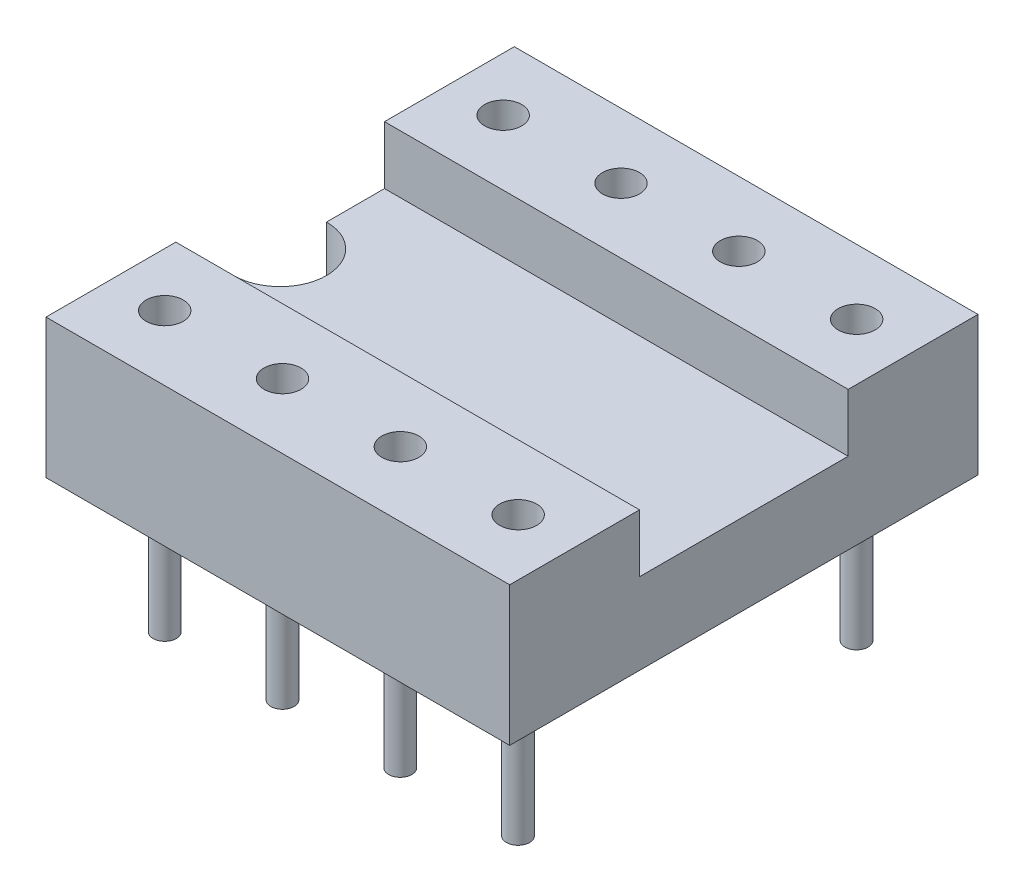
ISO-10303-21;
HEADER;
FILE_DESCRIPTION(('STEP AP214'),'2;1');
FILE_NAME('part.step','',(''),(''),'','','');
FILE_SCHEMA(('AUTOMOTIVE_DESIGN { 1 0 10303 214 1 1 1 1 }'));
ENDSEC;
DATA;
#1=APPLICATION_CONTEXT('core data for automotive mechanical design processes');
#2=APPLICATION_PROTOCOL_DEFINITION('international standard','automotive_design',2000,#1);
#3=PRODUCT_CONTEXT('',#1,'mechanical');
#4=PRODUCT('Part','Part','',(#3));
#5=PRODUCT_RELATED_PRODUCT_CATEGORY('part','',(#4));
#6=PRODUCT_DEFINITION_FORMATION('','',#4);
#7=PRODUCT_DEFINITION_CONTEXT('part definition',#1,'design');
#8=PRODUCT_DEFINITION('design','',#6,#7);
#9=PRODUCT_DEFINITION_SHAPE('','',#8);
#10=(LENGTH_UNIT() NAMED_UNIT(*) SI_UNIT(.MILLI.,.METRE.));
#11=(NAMED_UNIT(*) PLANE_ANGLE_UNIT() SI_UNIT($,.RADIAN.));
#12=(NAMED_UNIT(*) SI_UNIT($,.STERADIAN.) SOLID_ANGLE_UNIT());
#13=UNCERTAINTY_MEASURE_WITH_UNIT(LENGTH_MEASURE(1.E-05),#10,'distance_accuracy_value','');
#14=(GEOMETRIC_REPRESENTATION_CONTEXT(3) GLOBAL_UNCERTAINTY_ASSIGNED_CONTEXT((#13)) GLOBAL_UNIT_ASSIGNED_CONTEXT((#10,
#11,#12)) REPRESENTATION_CONTEXT('',''));
#15=CARTESIAN_POINT('',(0.,0.,0.));
#16=DIRECTION('',(0.,0.,1.));
#17=DIRECTION('',(1.,0.,0.));
#18=AXIS2_PLACEMENT_3D('',#15,#16,#17);
#19=CARTESIAN_POINT('',(10.,0.,5.05));
#20=DIRECTION('',(0.,1.,0.));
#21=DIRECTION('',(0.,0.,1.));
#22=AXIS2_PLACEMENT_3D('',#19,#20,#21);
#23=PLANE('',#22);
#24=CARTESIAN_POINT('',(8.78,0.,3.65));
#25=DIRECTION('',(0.,1.,0.));
#26=DIRECTION('',(0.,0.,1.));
#27=AXIS2_PLACEMENT_3D('',#24,#25,#26);
#28=CIRCLE('',#27,0.25);
#29=CARTESIAN_POINT('',(8.78,0.,3.9));
#30=VERTEX_POINT('',#29);
#31=EDGE_CURVE('E42',#30,#30,#28,.F.);
#32=ORIENTED_EDGE('',*,*,#31,.F.);
#33=EDGE_LOOP('',(#32));
#34=FACE_BOUND('',#33,.T.);
#35=CARTESIAN_POINT('',(6.24,0.,3.65));
#36=DIRECTION('',(0.,1.,0.));
#37=DIRECTION('',(0.,0.,1.));
#38=AXIS2_PLACEMENT_3D('',#35,#36,#37);
#39=CIRCLE('',#38,0.25);
#40=CARTESIAN_POINT('',(6.24,0.,3.9));
#41=VERTEX_POINT('',#40);
#42=EDGE_CURVE('E200',#41,#41,#39,.F.);
#43=ORIENTED_EDGE('',*,*,#42,.F.);
#44=EDGE_LOOP('',(#43));
#45=FACE_BOUND('',#44,.T.);
#46=CARTESIAN_POINT('',(3.7,0.,3.65));
#47=DIRECTION('',(0.,1.,0.));
#48=DIRECTION('',(0.,0.,1.));
#49=AXIS2_PLACEMENT_3D('',#46,#47,#48);
#50=CIRCLE('',#49,0.25);
#51=CARTESIAN_POINT('',(3.7,0.,3.9));
#52=VERTEX_POINT('',#51);
#53=EDGE_CURVE('E194',#52,#52,#50,.F.);
#54=ORIENTED_EDGE('',*,*,#53,.F.);
#55=EDGE_LOOP('',(#54));
#56=FACE_BOUND('',#55,.T.);
#57=CARTESIAN_POINT('',(1.16,0.,3.65));
#58=DIRECTION('',(0.,1.,0.));
#59=DIRECTION('',(0.,0.,1.));
#60=AXIS2_PLACEMENT_3D('',#57,#58,#59);
#61=CIRCLE('',#60,0.25);
#62=CARTESIAN_POINT('',(1.16,0.,3.9));
#63=VERTEX_POINT('',#62);
#64=EDGE_CURVE('E188',#63,#63,#61,.F.);
#65=ORIENTED_EDGE('',*,*,#64,.F.);
#66=EDGE_LOOP('',(#65));
#67=FACE_BOUND('',#66,.T.);
#68=DIRECTION('',(0.,0.,-1.));
#69=VECTOR('',#68,1.);
#70=CARTESIAN_POINT('',(0.,0.,5.05));
#71=LINE('',#70,#69);
#72=CARTESIAN_POINT('',(0.,0.,5.05));
#73=VERTEX_POINT('',#72);
#74=CARTESIAN_POINT('',(0.,0.,1.));
#75=VERTEX_POINT('',#74);
#76=EDGE_CURVE('E142',#73,#75,#71,.T.);
#77=ORIENTED_EDGE('',*,*,#76,.T.);
#78=CARTESIAN_POINT('',(0.,0.,0.));
#79=DIRECTION('',(0.,1.,0.));
#80=DIRECTION('',(0.,0.,1.));
#81=AXIS2_PLACEMENT_3D('',#78,#79,#80);
#82=CIRCLE('',#81,1.);
#83=CARTESIAN_POINT('',(0.,0.,-1.));
#84=VERTEX_POINT('',#83);
#85=EDGE_CURVE('E49',#75,#84,#82,.T.);
#86=ORIENTED_EDGE('',*,*,#85,.T.);
#87=CARTESIAN_POINT('',(0.,0.,-5.05));
#88=VERTEX_POINT('',#87);
#89=EDGE_CURVE('E127',#84,#88,#71,.T.);
#90=ORIENTED_EDGE('',*,*,#89,.T.);
#91=DIRECTION('',(-1.,0.,0.));
#92=VECTOR('',#91,1.);
#93=CARTESIAN_POINT('',(10.,0.,-5.05));
#94=LINE('',#93,#92);
#95=CARTESIAN_POINT('',(10.,0.,-5.05));
#96=VERTEX_POINT('',#95);
#97=EDGE_CURVE('E173',#96,#88,#94,.T.);
#98=ORIENTED_EDGE('',*,*,#97,.F.);
#99=DIRECTION('',(0.,0.,-1.));
#100=VECTOR('',#99,1.);
#101=CARTESIAN_POINT('',(10.,0.,5.05));
#102=LINE('',#101,#100);
#103=CARTESIAN_POINT('',(10.,0.,5.05));
#104=VERTEX_POINT('',#103);
#105=EDGE_CURVE('E159',#104,#96,#102,.T.);
#106=ORIENTED_EDGE('',*,*,#105,.F.);
#107=DIRECTION('',(-1.,0.,0.));
#108=VECTOR('',#107,1.);
#109=CARTESIAN_POINT('',(10.,0.,5.05));
#110=LINE('',#109,#108);
#111=EDGE_CURVE('E176',#104,#73,#110,.T.);
#112=ORIENTED_EDGE('',*,*,#111,.T.);
#113=EDGE_LOOP('',(#77,#86,#90,#98,#106,#112));
#114=FACE_BOUND('',#113,.T.);
#115=CARTESIAN_POINT('',(1.16,0.,-3.65));
#116=DIRECTION('',(0.,1.,0.));
#117=DIRECTION('',(0.,0.,1.));
#118=AXIS2_PLACEMENT_3D('',#115,#116,#117);
#119=CIRCLE('',#118,0.25);
#120=CARTESIAN_POINT('',(1.16,0.,-3.4));
#121=VERTEX_POINT('',#120);
#122=EDGE_CURVE('E191',#121,#121,#119,.F.);
#123=ORIENTED_EDGE('',*,*,#122,.F.);
#124=EDGE_LOOP('',(#123));
#125=FACE_BOUND('',#124,.T.);
#126=CARTESIAN_POINT('',(3.7,0.,-3.65));
#127=DIRECTION('',(0.,1.,0.));
#128=DIRECTION('',(0.,0.,1.));
#129=AXIS2_PLACEMENT_3D('',#126,#127,#128);
#130=CIRCLE('',#129,0.25);
#131=CARTESIAN_POINT('',(3.7,0.,-3.4));
#132=VERTEX_POINT('',#131);
#133=EDGE_CURVE('E197',#132,#132,#130,.F.);
#134=ORIENTED_EDGE('',*,*,#133,.F.);
#135=EDGE_LOOP('',(#134));
#136=FACE_BOUND('',#135,.T.);
#137=CARTESIAN_POINT('',(6.24,0.,-3.65));
#138=DIRECTION('',(0.,1.,0.));
#139=DIRECTION('',(0.,0.,1.));
#140=AXIS2_PLACEMENT_3D('',#137,#138,#139);
#141=CIRCLE('',#140,0.25);
#142=CARTESIAN_POINT('',(6.24,0.,-3.4));
#143=VERTEX_POINT('',#142);
#144=EDGE_CURVE('E203',#143,#143,#141,.F.);
#145=ORIENTED_EDGE('',*,*,#144,.F.);
#146=EDGE_LOOP('',(#145));
#147=FACE_BOUND('',#146,.T.);
#148=CARTESIAN_POINT('',(8.78,0.,-3.65));
#149=DIRECTION('',(0.,1.,0.));
#150=DIRECTION('',(0.,0.,1.));
#151=AXIS2_PLACEMENT_3D('',#148,#149,#150);
#152=CIRCLE('',#151,0.25);
#153=CARTESIAN_POINT('',(8.78,0.,-3.4));
#154=VERTEX_POINT('',#153);
#155=EDGE_CURVE('E11',#154,#154,#152,.F.);
#156=ORIENTED_EDGE('',*,*,#155,.F.);
#157=EDGE_LOOP('',(#156));
#158=FACE_BOUND('',#157,.T.);
#159=ADVANCED_FACE('F34',(#34,#45,#56,#67,#114,#125,#136,#147,#158),#23,.F.);
#160=CARTESIAN_POINT('',(0.,1.75,5.05));
#161=DIRECTION('',(1.,0.,0.));
#162=DIRECTION('',(0.,0.,-1.));
#163=AXIS2_PLACEMENT_3D('',#160,#161,#162);
#164=PLANE('',#163);
#165=ORIENTED_EDGE('',*,*,#89,.F.);
#166=DIRECTION('',(0.,1.,0.));
#167=VECTOR('',#166,1.);
#168=CARTESIAN_POINT('',(0.,0.,-1.));
#169=LINE('',#168,#167);
#170=CARTESIAN_POINT('',(0.,1.75,-1.));
#171=VERTEX_POINT('',#170);
#172=EDGE_CURVE('E113',#84,#171,#169,.T.);
#173=ORIENTED_EDGE('',*,*,#172,.T.);
#174=DIRECTION('',(0.,0.,1.));
#175=VECTOR('',#174,1.);
#176=CARTESIAN_POINT('',(0.,1.75,-2.25));
#177=LINE('',#176,#175);
#178=CARTESIAN_POINT('',(0.,1.75,-2.25));
#179=VERTEX_POINT('',#178);
#180=EDGE_CURVE('E125',#179,#171,#177,.T.);
#181=ORIENTED_EDGE('',*,*,#180,.F.);
#182=DIRECTION('',(0.,-1.,0.));
#183=VECTOR('',#182,1.);
#184=CARTESIAN_POINT('',(0.,3.,-2.25));
#185=LINE('',#184,#183);
#186=CARTESIAN_POINT('',(0.,3.,-2.25));
#187=VERTEX_POINT('',#186);
#188=EDGE_CURVE('E149',#187,#179,#185,.T.);
#189=ORIENTED_EDGE('',*,*,#188,.F.);
#190=DIRECTION('',(0.,0.,1.));
#191=VECTOR('',#190,1.);
#192=CARTESIAN_POINT('',(0.,3.,-5.05));
#193=LINE('',#192,#191);
#194=CARTESIAN_POINT('',(0.,3.,-5.05));
#195=VERTEX_POINT('',#194);
#196=EDGE_CURVE('E147',#195,#187,#193,.T.);
#197=ORIENTED_EDGE('',*,*,#196,.F.);
#198=DIRECTION('',(0.,1.,0.));
#199=VECTOR('',#198,1.);
#200=CARTESIAN_POINT('',(0.,0.,-5.05));
#201=LINE('',#200,#199);
#202=EDGE_CURVE('E145',#88,#195,#201,.T.);
#203=ORIENTED_EDGE('',*,*,#202,.F.);
#204=EDGE_LOOP('',(#165,#173,#181,#189,#197,#203));
#205=FACE_BOUND('',#204,.T.);
#206=ADVANCED_FACE('F123',(#205),#164,.F.);
#207=CARTESIAN_POINT('',(10.,1.75,-2.25));
#208=DIRECTION('',(0.,-1.,0.));
#209=DIRECTION('',(0.,0.,-1.));
#210=AXIS2_PLACEMENT_3D('',#207,#208,#209);
#211=PLANE('',#210);
#212=ORIENTED_EDGE('',*,*,#180,.T.);
#213=CARTESIAN_POINT('',(0.,1.75,0.));
#214=DIRECTION('',(0.,1.,0.));
#215=DIRECTION('',(0.,0.,1.));
#216=AXIS2_PLACEMENT_3D('',#213,#214,#215);
#217=CIRCLE('',#216,1.);
#218=CARTESIAN_POINT('',(0.,1.75,1.));
#219=VERTEX_POINT('',#218);
#220=EDGE_CURVE('E110',#219,#171,#217,.T.);
#221=ORIENTED_EDGE('',*,*,#220,.F.);
#222=CARTESIAN_POINT('',(0.,1.75,2.25));
#223=VERTEX_POINT('',#222);
#224=EDGE_CURVE('E133',#219,#223,#177,.T.);
#225=ORIENTED_EDGE('',*,*,#224,.T.);
#226=DIRECTION('',(-1.,0.,0.));
#227=VECTOR('',#226,1.);
#228=CARTESIAN_POINT('',(10.,1.75,2.25));
#229=LINE('',#228,#227);
#230=CARTESIAN_POINT('',(10.,1.75,2.25));
#231=VERTEX_POINT('',#230);
#232=EDGE_CURVE('E185',#231,#223,#229,.T.);
#233=ORIENTED_EDGE('',*,*,#232,.F.);
#234=DIRECTION('',(0.,0.,1.));
#235=VECTOR('',#234,1.);
#236=CARTESIAN_POINT('',(10.,1.75,-2.25));
#237=LINE('',#236,#235);
#238=CARTESIAN_POINT('',(10.,1.75,-2.25));
#239=VERTEX_POINT('',#238);
#240=EDGE_CURVE('E151',#239,#231,#237,.T.);
#241=ORIENTED_EDGE('',*,*,#240,.F.);
#242=DIRECTION('',(-1.,0.,0.));
#243=VECTOR('',#242,1.);
#244=CARTESIAN_POINT('',(10.,1.75,-2.25));
#245=LINE('',#244,#243);
#246=EDGE_CURVE('E131',#239,#179,#245,.T.);
#247=ORIENTED_EDGE('',*,*,#246,.T.);
#248=EDGE_LOOP('',(#212,#221,#225,#233,#241,#247));
#249=FACE_BOUND('',#248,.T.);
#250=ADVANCED_FACE('F36',(#249),#211,.F.);
#251=CARTESIAN_POINT('',(10.,1.75,2.25));
#252=DIRECTION('',(0.,0.,1.));
#253=DIRECTION('',(0.,-1.,0.));
#254=AXIS2_PLACEMENT_3D('',#251,#252,#253);
#255=PLANE('',#254);
#256=DIRECTION('',(0.,1.,0.));
#257=VECTOR('',#256,1.);
#258=CARTESIAN_POINT('',(0.,1.75,2.25));
#259=LINE('',#258,#257);
#260=CARTESIAN_POINT('',(0.,3.,2.25));
#261=VERTEX_POINT('',#260);
#262=EDGE_CURVE('E132',#223,#261,#259,.T.);
#263=ORIENTED_EDGE('',*,*,#262,.T.);
#264=DIRECTION('',(-1.,0.,0.));
#265=VECTOR('',#264,1.);
#266=CARTESIAN_POINT('',(10.,3.,2.25));
#267=LINE('',#266,#265);
#268=CARTESIAN_POINT('',(10.,3.,2.25));
#269=VERTEX_POINT('',#268);
#270=EDGE_CURVE('E182',#269,#261,#267,.T.);
#271=ORIENTED_EDGE('',*,*,#270,.F.);
#272=DIRECTION('',(0.,1.,0.));
#273=VECTOR('',#272,1.);
#274=CARTESIAN_POINT('',(10.,1.75,2.25));
#275=LINE('',#274,#273);
#276=EDGE_CURVE('E153',#231,#269,#275,.T.);
#277=ORIENTED_EDGE('',*,*,#276,.F.);
#278=ORIENTED_EDGE('',*,*,#232,.T.);
#279=EDGE_LOOP('',(#263,#271,#277,#278));
#280=FACE_BOUND('',#279,.T.);
#281=ADVANCED_FACE('F387',(#280),#255,.F.);
#282=CARTESIAN_POINT('',(10.,3.,2.25));
#283=DIRECTION('',(0.,-1.,0.));
#284=DIRECTION('',(0.,0.,-1.));
#285=AXIS2_PLACEMENT_3D('',#282,#283,#284);
#286=PLANE('',#285);
#287=CARTESIAN_POINT('',(8.783,3.,3.64999999999995));
#288=DIRECTION('',(0.,1.,0.));
#289=DIRECTION('',(0.,0.,1.));
#290=AXIS2_PLACEMENT_3D('',#287,#288,#289);
#291=CIRCLE('',#290,0.399999999999999);
#292=CARTESIAN_POINT('',(8.783,3.,4.04999999999995));
#293=VERTEX_POINT('',#292);
#294=EDGE_CURVE('E448',#293,#293,#291,.T.);
#295=ORIENTED_EDGE('',*,*,#294,.F.);
#296=EDGE_LOOP('',(#295));
#297=FACE_BOUND('',#296,.T.);
#298=CARTESIAN_POINT('',(6.242,3.,3.64999999999996));
#299=DIRECTION('',(0.,1.,0.));
#300=DIRECTION('',(0.,0.,1.));
#301=AXIS2_PLACEMENT_3D('',#298,#299,#300);
#302=CIRCLE('',#301,0.4);
#303=CARTESIAN_POINT('',(6.242,3.,4.04999999999996));
#304=VERTEX_POINT('',#303);
#305=EDGE_CURVE('E436',#304,#304,#302,.T.);
#306=ORIENTED_EDGE('',*,*,#305,.F.);
#307=EDGE_LOOP('',(#306));
#308=FACE_BOUND('',#307,.T.);
#309=CARTESIAN_POINT('',(3.701,3.,3.64999999999998));
#310=DIRECTION('',(0.,1.,0.));
#311=DIRECTION('',(0.,0.,1.));
#312=AXIS2_PLACEMENT_3D('',#309,#310,#311);
#313=CIRCLE('',#312,0.4);
#314=CARTESIAN_POINT('',(3.701,3.,4.04999999999998));
#315=VERTEX_POINT('',#314);
#316=EDGE_CURVE('E424',#315,#315,#313,.T.);
#317=ORIENTED_EDGE('',*,*,#316,.F.);
#318=EDGE_LOOP('',(#317));
#319=FACE_BOUND('',#318,.T.);
#320=CARTESIAN_POINT('',(1.16,3.,3.65));
#321=DIRECTION('',(0.,1.,0.));
#322=DIRECTION('',(0.,0.,1.));
#323=AXIS2_PLACEMENT_3D('',#320,#321,#322);
#324=CIRCLE('',#323,0.4);
#325=CARTESIAN_POINT('',(1.16,3.,4.05));
#326=VERTEX_POINT('',#325);
#327=EDGE_CURVE('E412',#326,#326,#324,.T.);
#328=ORIENTED_EDGE('',*,*,#327,.F.);
#329=EDGE_LOOP('',(#328));
#330=FACE_BOUND('',#329,.T.);
#331=DIRECTION('',(0.,0.,1.));
#332=VECTOR('',#331,1.);
#333=CARTESIAN_POINT('',(0.,3.,2.25));
#334=LINE('',#333,#332);
#335=CARTESIAN_POINT('',(0.,3.,5.05));
#336=VERTEX_POINT('',#335);
#337=EDGE_CURVE('E135',#261,#336,#334,.T.);
#338=ORIENTED_EDGE('',*,*,#337,.T.);
#339=DIRECTION('',(-1.,0.,0.));
#340=VECTOR('',#339,1.);
#341=CARTESIAN_POINT('',(10.,3.,5.05));
#342=LINE('',#341,#340);
#343=CARTESIAN_POINT('',(10.,3.,5.05));
#344=VERTEX_POINT('',#343);
#345=EDGE_CURVE('E179',#344,#336,#342,.T.);
#346=ORIENTED_EDGE('',*,*,#345,.F.);
#347=DIRECTION('',(0.,0.,1.));
#348=VECTOR('',#347,1.);
#349=CARTESIAN_POINT('',(10.,3.,2.25));
#350=LINE('',#349,#348);
#351=EDGE_CURVE('E155',#269,#344,#350,.T.);
#352=ORIENTED_EDGE('',*,*,#351,.F.);
#353=ORIENTED_EDGE('',*,*,#270,.T.);
#354=EDGE_LOOP('',(#338,#346,#352,#353));
#355=FACE_BOUND('',#354,.T.);
#356=ADVANCED_FACE('F384',(#297,#308,#319,#330,#355),#286,.F.);
#357=CARTESIAN_POINT('',(10.,3.,5.05));
#358=DIRECTION('',(0.,0.,-1.));
#359=DIRECTION('',(-1.,0.,0.));
#360=AXIS2_PLACEMENT_3D('',#357,#358,#359);
#361=PLANE('',#360);
#362=DIRECTION('',(0.,-1.,0.));
#363=VECTOR('',#362,1.);
#364=CARTESIAN_POINT('',(0.,3.,5.05));
#365=LINE('',#364,#363);
#366=EDGE_CURVE('E140',#336,#73,#365,.T.);
#367=ORIENTED_EDGE('',*,*,#366,.T.);
#368=ORIENTED_EDGE('',*,*,#111,.F.);
#369=DIRECTION('',(0.,-1.,0.));
#370=VECTOR('',#369,1.);
#371=CARTESIAN_POINT('',(10.,3.,5.05));
#372=LINE('',#371,#370);
#373=EDGE_CURVE('E157',#344,#104,#372,.T.);
#374=ORIENTED_EDGE('',*,*,#373,.F.);
#375=ORIENTED_EDGE('',*,*,#345,.T.);
#376=EDGE_LOOP('',(#367,#368,#374,#375));
#377=FACE_BOUND('',#376,.T.);
#378=ADVANCED_FACE('F379',(#377),#361,.F.);
#379=CARTESIAN_POINT('',(10.,0.,-5.05));
#380=DIRECTION('',(0.,0.,1.));
#381=DIRECTION('',(0.,-1.,0.));
#382=AXIS2_PLACEMENT_3D('',#379,#380,#381);
#383=PLANE('',#382);
#384=ORIENTED_EDGE('',*,*,#202,.T.);
#385=DIRECTION('',(-1.,0.,0.));
#386=VECTOR('',#385,1.);
#387=CARTESIAN_POINT('',(10.,3.,-5.05));
#388=LINE('',#387,#386);
#389=CARTESIAN_POINT('',(10.,3.,-5.05));
#390=VERTEX_POINT('',#389);
#391=EDGE_CURVE('E170',#390,#195,#388,.T.);
#392=ORIENTED_EDGE('',*,*,#391,.F.);
#393=DIRECTION('',(0.,1.,0.));
#394=VECTOR('',#393,1.);
#395=CARTESIAN_POINT('',(10.,0.,-5.05));
#396=LINE('',#395,#394);
#397=EDGE_CURVE('E161',#96,#390,#396,.T.);
#398=ORIENTED_EDGE('',*,*,#397,.F.);
#399=ORIENTED_EDGE('',*,*,#97,.T.);
#400=EDGE_LOOP('',(#384,#392,#398,#399));
#401=FACE_BOUND('',#400,.T.);
#402=ADVANCED_FACE('F376',(#401),#383,.F.);
#403=CARTESIAN_POINT('',(10.,3.,-5.05));
#404=DIRECTION('',(0.,-1.,0.));
#405=DIRECTION('',(0.,0.,-1.));
#406=AXIS2_PLACEMENT_3D('',#403,#404,#405);
#407=PLANE('',#406);
#408=CARTESIAN_POINT('',(8.783,3.,-3.65000000000005));
#409=DIRECTION('',(0.,1.,0.));
#410=DIRECTION('',(0.,0.,-1.));
#411=AXIS2_PLACEMENT_3D('',#408,#409,#410);
#412=CIRCLE('',#411,0.399999999999999);
#413=CARTESIAN_POINT('',(8.783,3.,-4.05000000000005));
#414=VERTEX_POINT('',#413);
#415=EDGE_CURVE('E454',#414,#414,#412,.T.);
#416=ORIENTED_EDGE('',*,*,#415,.F.);
#417=EDGE_LOOP('',(#416));
#418=FACE_BOUND('',#417,.T.);
#419=CARTESIAN_POINT('',(6.242,3.,-3.65000000000003));
#420=DIRECTION('',(0.,1.,0.));
#421=DIRECTION('',(0.,0.,-1.));
#422=AXIS2_PLACEMENT_3D('',#419,#420,#421);
#423=CIRCLE('',#422,0.4);
#424=CARTESIAN_POINT('',(6.242,3.,-4.05000000000004));
#425=VERTEX_POINT('',#424);
#426=EDGE_CURVE('E442',#425,#425,#423,.T.);
#427=ORIENTED_EDGE('',*,*,#426,.F.);
#428=EDGE_LOOP('',(#427));
#429=FACE_BOUND('',#428,.T.);
#430=CARTESIAN_POINT('',(3.701,3.,-3.65000000000002));
#431=DIRECTION('',(0.,1.,0.));
#432=DIRECTION('',(0.,0.,-1.));
#433=AXIS2_PLACEMENT_3D('',#430,#431,#432);
#434=CIRCLE('',#433,0.4);
#435=CARTESIAN_POINT('',(3.701,3.,-4.05000000000002));
#436=VERTEX_POINT('',#435);
#437=EDGE_CURVE('E430',#436,#436,#434,.T.);
#438=ORIENTED_EDGE('',*,*,#437,.F.);
#439=EDGE_LOOP('',(#438));
#440=FACE_BOUND('',#439,.T.);
#441=CARTESIAN_POINT('',(1.16,3.,-3.65));
#442=DIRECTION('',(0.,1.,0.));
#443=DIRECTION('',(0.,0.,-1.));
#444=AXIS2_PLACEMENT_3D('',#441,#442,#443);
#445=CIRCLE('',#444,0.4);
#446=CARTESIAN_POINT('',(1.16,3.,-4.05));
#447=VERTEX_POINT('',#446);
#448=EDGE_CURVE('E418',#447,#447,#445,.T.);
#449=ORIENTED_EDGE('',*,*,#448,.F.);
#450=EDGE_LOOP('',(#449));
#451=FACE_BOUND('',#450,.T.);
#452=ORIENTED_EDGE('',*,*,#196,.T.);
#453=DIRECTION('',(-1.,0.,0.));
#454=VECTOR('',#453,1.);
#455=CARTESIAN_POINT('',(10.,3.,-2.25));
#456=LINE('',#455,#454);
#457=CARTESIAN_POINT('',(10.,3.,-2.25));
#458=VERTEX_POINT('',#457);
#459=EDGE_CURVE('E167',#458,#187,#456,.T.);
#460=ORIENTED_EDGE('',*,*,#459,.F.);
#461=DIRECTION('',(0.,0.,1.));
#462=VECTOR('',#461,1.);
#463=CARTESIAN_POINT('',(10.,3.,-5.05));
#464=LINE('',#463,#462);
#465=EDGE_CURVE('E163',#390,#458,#464,.T.);
#466=ORIENTED_EDGE('',*,*,#465,.F.);
#467=ORIENTED_EDGE('',*,*,#391,.T.);
#468=EDGE_LOOP('',(#452,#460,#466,#467));
#469=FACE_BOUND('',#468,.T.);
#470=ADVANCED_FACE('F372',(#418,#429,#440,#451,#469),#407,.F.);
#471=CARTESIAN_POINT('',(10.,3.,-2.25));
#472=DIRECTION('',(0.,0.,-1.));
#473=DIRECTION('',(0.,1.,0.));
#474=AXIS2_PLACEMENT_3D('',#471,#472,#473);
#475=PLANE('',#474);
#476=ORIENTED_EDGE('',*,*,#188,.T.);
#477=ORIENTED_EDGE('',*,*,#246,.F.);
#478=DIRECTION('',(0.,-1.,0.));
#479=VECTOR('',#478,1.);
#480=CARTESIAN_POINT('',(10.,3.,-2.25));
#481=LINE('',#480,#479);
#482=EDGE_CURVE('E57',#458,#239,#481,.T.);
#483=ORIENTED_EDGE('',*,*,#482,.F.);
#484=ORIENTED_EDGE('',*,*,#459,.T.);
#485=EDGE_LOOP('',(#476,#477,#483,#484));
#486=FACE_BOUND('',#485,.T.);
#487=ADVANCED_FACE('F369',(#486),#475,.F.);
#488=CARTESIAN_POINT('',(10.,1.75,5.05));
#489=DIRECTION('',(1.,0.,0.));
#490=DIRECTION('',(0.,0.,-1.));
#491=AXIS2_PLACEMENT_3D('',#488,#489,#490);
#492=PLANE('',#491);
#493=ORIENTED_EDGE('',*,*,#240,.T.);
#494=ORIENTED_EDGE('',*,*,#276,.T.);
#495=ORIENTED_EDGE('',*,*,#351,.T.);
#496=ORIENTED_EDGE('',*,*,#373,.T.);
#497=ORIENTED_EDGE('',*,*,#105,.T.);
#498=ORIENTED_EDGE('',*,*,#397,.T.);
#499=ORIENTED_EDGE('',*,*,#465,.T.);
#500=ORIENTED_EDGE('',*,*,#482,.T.);
#501=EDGE_LOOP('',(#493,#494,#495,#496,#497,#498,#499,#500));
#502=FACE_BOUND('',#501,.T.);
#503=ADVANCED_FACE('F365',(#502),#492,.T.);
#504=ORIENTED_EDGE('',*,*,#224,.F.);
#505=DIRECTION('',(0.,1.,0.));
#506=VECTOR('',#505,1.);
#507=CARTESIAN_POINT('',(0.,0.,1.));
#508=LINE('',#507,#506);
#509=EDGE_CURVE('E114',#75,#219,#508,.T.);
#510=ORIENTED_EDGE('',*,*,#509,.F.);
#511=ORIENTED_EDGE('',*,*,#76,.F.);
#512=ORIENTED_EDGE('',*,*,#366,.F.);
#513=ORIENTED_EDGE('',*,*,#337,.F.);
#514=ORIENTED_EDGE('',*,*,#262,.F.);
#515=EDGE_LOOP('',(#504,#510,#511,#512,#513,#514));
#516=FACE_BOUND('',#515,.T.);
#517=ADVANCED_FACE('F362',(#516),#164,.F.);
#518=CARTESIAN_POINT('',(0.,0.,0.));
#519=DIRECTION('',(0.,1.,0.));
#520=DIRECTION('',(0.,0.,1.));
#521=AXIS2_PLACEMENT_3D('',#518,#519,#520);
#522=CYLINDRICAL_SURFACE('',#521,1.);
#523=ORIENTED_EDGE('',*,*,#220,.T.);
#524=ORIENTED_EDGE('',*,*,#172,.F.);
#525=ORIENTED_EDGE('',*,*,#85,.F.);
#526=ORIENTED_EDGE('',*,*,#509,.T.);
#527=EDGE_LOOP('',(#523,#524,#525,#526));
#528=FACE_BOUND('',#527,.T.);
#529=ADVANCED_FACE('F112',(#528),#522,.F.);
#530=CARTESIAN_POINT('',(1.16,0.5,3.65));
#531=DIRECTION('',(0.,1.,0.));
#532=DIRECTION('',(0.,0.,1.));
#533=AXIS2_PLACEMENT_3D('',#530,#531,#532);
#534=CYLINDRICAL_SURFACE('',#533,0.4);
#535=CARTESIAN_POINT('',(1.16,0.5,3.65));
#536=DIRECTION('',(0.,1.,0.));
#537=DIRECTION('',(0.,0.,1.));
#538=AXIS2_PLACEMENT_3D('',#535,#536,#537);
#539=CIRCLE('',#538,0.4);
#540=CARTESIAN_POINT('',(1.16,0.5,4.05));
#541=VERTEX_POINT('',#540);
#542=EDGE_CURVE('E118',#541,#541,#539,.T.);
#543=ORIENTED_EDGE('',*,*,#542,.F.);
#544=EDGE_LOOP('',(#543));
#545=FACE_BOUND('',#544,.T.);
#546=ORIENTED_EDGE('',*,*,#327,.T.);
#547=EDGE_LOOP('',(#546));
#548=FACE_BOUND('',#547,.T.);
#549=ADVANCED_FACE('F355',(#545,#548),#534,.F.);
#550=CARTESIAN_POINT('',(1.16,0.5,3.65));
#551=DIRECTION('',(0.,1.,0.));
#552=DIRECTION('',(0.,0.,1.));
#553=AXIS2_PLACEMENT_3D('',#550,#551,#552);
#554=PLANE('',#553);
#555=ORIENTED_EDGE('',*,*,#542,.T.);
#556=EDGE_LOOP('',(#555));
#557=FACE_BOUND('',#556,.T.);
#558=ADVANCED_FACE('F351',(#557),#554,.T.);
#559=CARTESIAN_POINT('',(1.16,0.5,-3.65));
#560=DIRECTION('',(0.,1.,0.));
#561=DIRECTION('',(0.,0.,1.));
#562=AXIS2_PLACEMENT_3D('',#559,#560,#561);
#563=CYLINDRICAL_SURFACE('',#562,0.4);
#564=CARTESIAN_POINT('',(1.16,0.5,-3.65));
#565=DIRECTION('',(0.,1.,0.));
#566=DIRECTION('',(0.,0.,-1.));
#567=AXIS2_PLACEMENT_3D('',#564,#565,#566);
#568=CIRCLE('',#567,0.4);
#569=CARTESIAN_POINT('',(1.16,0.5,-4.05));
#570=VERTEX_POINT('',#569);
#571=EDGE_CURVE('E415',#570,#570,#568,.T.);
#572=ORIENTED_EDGE('',*,*,#571,.F.);
#573=EDGE_LOOP('',(#572));
#574=FACE_BOUND('',#573,.T.);
#575=ORIENTED_EDGE('',*,*,#448,.T.);
#576=EDGE_LOOP('',(#575));
#577=FACE_BOUND('',#576,.T.);
#578=ADVANCED_FACE('F347',(#574,#577),#563,.F.);
#579=CARTESIAN_POINT('',(1.16,0.5,-3.65));
#580=DIRECTION('',(0.,-1.,0.));
#581=DIRECTION('',(0.,0.,-1.));
#582=AXIS2_PLACEMENT_3D('',#579,#580,#581);
#583=PLANE('',#582);
#584=ORIENTED_EDGE('',*,*,#571,.T.);
#585=EDGE_LOOP('',(#584));
#586=FACE_BOUND('',#585,.T.);
#587=ADVANCED_FACE('F343',(#586),#583,.F.);
#588=CARTESIAN_POINT('',(3.701,0.5,3.64999999999998));
#589=DIRECTION('',(0.,1.,0.));
#590=DIRECTION('',(0.,0.,1.));
#591=AXIS2_PLACEMENT_3D('',#588,#589,#590);
#592=CYLINDRICAL_SURFACE('',#591,0.4);
#593=CARTESIAN_POINT('',(3.701,0.5,3.64999999999998));
#594=DIRECTION('',(0.,1.,0.));
#595=DIRECTION('',(0.,0.,1.));
#596=AXIS2_PLACEMENT_3D('',#593,#594,#595);
#597=CIRCLE('',#596,0.4);
#598=CARTESIAN_POINT('',(3.701,0.5,4.04999999999998));
#599=VERTEX_POINT('',#598);
#600=EDGE_CURVE('E421',#599,#599,#597,.T.);
#601=ORIENTED_EDGE('',*,*,#600,.F.);
#602=EDGE_LOOP('',(#601));
#603=FACE_BOUND('',#602,.T.);
#604=ORIENTED_EDGE('',*,*,#316,.T.);
#605=EDGE_LOOP('',(#604));
#606=FACE_BOUND('',#605,.T.);
#607=ADVANCED_FACE('F339',(#603,#606),#592,.F.);
#608=CARTESIAN_POINT('',(3.701,0.5,3.64999999999998));
#609=DIRECTION('',(0.,1.,0.));
#610=DIRECTION('',(0.,0.,1.));
#611=AXIS2_PLACEMENT_3D('',#608,#609,#610);
#612=PLANE('',#611);
#613=ORIENTED_EDGE('',*,*,#600,.T.);
#614=EDGE_LOOP('',(#613));
#615=FACE_BOUND('',#614,.T.);
#616=ADVANCED_FACE('F335',(#615),#612,.T.);
#617=CARTESIAN_POINT('',(3.701,0.5,-3.65000000000002));
#618=DIRECTION('',(0.,1.,0.));
#619=DIRECTION('',(0.,0.,1.));
#620=AXIS2_PLACEMENT_3D('',#617,#618,#619);
#621=CYLINDRICAL_SURFACE('',#620,0.4);
#622=CARTESIAN_POINT('',(3.701,0.5,-3.65000000000002));
#623=DIRECTION('',(0.,1.,0.));
#624=DIRECTION('',(0.,0.,-1.));
#625=AXIS2_PLACEMENT_3D('',#622,#623,#624);
#626=CIRCLE('',#625,0.4);
#627=CARTESIAN_POINT('',(3.701,0.5,-4.05000000000002));
#628=VERTEX_POINT('',#627);
#629=EDGE_CURVE('E427',#628,#628,#626,.T.);
#630=ORIENTED_EDGE('',*,*,#629,.F.);
#631=EDGE_LOOP('',(#630));
#632=FACE_BOUND('',#631,.T.);
#633=ORIENTED_EDGE('',*,*,#437,.T.);
#634=EDGE_LOOP('',(#633));
#635=FACE_BOUND('',#634,.T.);
#636=ADVANCED_FACE('F331',(#632,#635),#621,.F.);
#637=CARTESIAN_POINT('',(3.701,0.5,-3.65000000000002));
#638=DIRECTION('',(0.,-1.,0.));
#639=DIRECTION('',(0.,0.,-1.));
#640=AXIS2_PLACEMENT_3D('',#637,#638,#639);
#641=PLANE('',#640);
#642=ORIENTED_EDGE('',*,*,#629,.T.);
#643=EDGE_LOOP('',(#642));
#644=FACE_BOUND('',#643,.T.);
#645=ADVANCED_FACE('F327',(#644),#641,.F.);
#646=CARTESIAN_POINT('',(6.242,0.5,3.64999999999996));
#647=DIRECTION('',(0.,1.,0.));
#648=DIRECTION('',(0.,0.,1.));
#649=AXIS2_PLACEMENT_3D('',#646,#647,#648);
#650=CYLINDRICAL_SURFACE('',#649,0.4);
#651=CARTESIAN_POINT('',(6.242,0.5,3.64999999999996));
#652=DIRECTION('',(0.,1.,0.));
#653=DIRECTION('',(0.,0.,1.));
#654=AXIS2_PLACEMENT_3D('',#651,#652,#653);
#655=CIRCLE('',#654,0.4);
#656=CARTESIAN_POINT('',(6.242,0.5,4.04999999999996));
#657=VERTEX_POINT('',#656);
#658=EDGE_CURVE('E433',#657,#657,#655,.T.);
#659=ORIENTED_EDGE('',*,*,#658,.F.);
#660=EDGE_LOOP('',(#659));
#661=FACE_BOUND('',#660,.T.);
#662=ORIENTED_EDGE('',*,*,#305,.T.);
#663=EDGE_LOOP('',(#662));
#664=FACE_BOUND('',#663,.T.);
#665=ADVANCED_FACE('F323',(#661,#664),#650,.F.);
#666=CARTESIAN_POINT('',(6.242,0.5,3.64999999999996));
#667=DIRECTION('',(0.,1.,0.));
#668=DIRECTION('',(0.,0.,1.));
#669=AXIS2_PLACEMENT_3D('',#666,#667,#668);
#670=PLANE('',#669);
#671=ORIENTED_EDGE('',*,*,#658,.T.);
#672=EDGE_LOOP('',(#671));
#673=FACE_BOUND('',#672,.T.);
#674=ADVANCED_FACE('F319',(#673),#670,.T.);
#675=CARTESIAN_POINT('',(6.242,0.5,-3.65000000000003));
#676=DIRECTION('',(0.,1.,0.));
#677=DIRECTION('',(0.,0.,1.));
#678=AXIS2_PLACEMENT_3D('',#675,#676,#677);
#679=CYLINDRICAL_SURFACE('',#678,0.4);
#680=CARTESIAN_POINT('',(6.242,0.5,-3.65000000000003));
#681=DIRECTION('',(0.,1.,0.));
#682=DIRECTION('',(0.,0.,-1.));
#683=AXIS2_PLACEMENT_3D('',#680,#681,#682);
#684=CIRCLE('',#683,0.4);
#685=CARTESIAN_POINT('',(6.242,0.5,-4.05000000000004));
#686=VERTEX_POINT('',#685);
#687=EDGE_CURVE('E439',#686,#686,#684,.T.);
#688=ORIENTED_EDGE('',*,*,#687,.F.);
#689=EDGE_LOOP('',(#688));
#690=FACE_BOUND('',#689,.T.);
#691=ORIENTED_EDGE('',*,*,#426,.T.);
#692=EDGE_LOOP('',(#691));
#693=FACE_BOUND('',#692,.T.);
#694=ADVANCED_FACE('F315',(#690,#693),#679,.F.);
#695=CARTESIAN_POINT('',(6.242,0.5,-3.65000000000003));
#696=DIRECTION('',(0.,-1.,0.));
#697=DIRECTION('',(0.,0.,-1.));
#698=AXIS2_PLACEMENT_3D('',#695,#696,#697);
#699=PLANE('',#698);
#700=ORIENTED_EDGE('',*,*,#687,.T.);
#701=EDGE_LOOP('',(#700));
#702=FACE_BOUND('',#701,.T.);
#703=ADVANCED_FACE('F311',(#702),#699,.F.);
#704=CARTESIAN_POINT('',(8.783,0.5,3.64999999999995));
#705=DIRECTION('',(0.,1.,0.));
#706=DIRECTION('',(0.,0.,1.));
#707=AXIS2_PLACEMENT_3D('',#704,#705,#706);
#708=CYLINDRICAL_SURFACE('',#707,0.399999999999999);
#709=CARTESIAN_POINT('',(8.783,0.5,3.64999999999995));
#710=DIRECTION('',(0.,1.,0.));
#711=DIRECTION('',(0.,0.,1.));
#712=AXIS2_PLACEMENT_3D('',#709,#710,#711);
#713=CIRCLE('',#712,0.399999999999999);
#714=CARTESIAN_POINT('',(8.783,0.5,4.04999999999995));
#715=VERTEX_POINT('',#714);
#716=EDGE_CURVE('E445',#715,#715,#713,.T.);
#717=ORIENTED_EDGE('',*,*,#716,.F.);
#718=EDGE_LOOP('',(#717));
#719=FACE_BOUND('',#718,.T.);
#720=ORIENTED_EDGE('',*,*,#294,.T.);
#721=EDGE_LOOP('',(#720));
#722=FACE_BOUND('',#721,.T.);
#723=ADVANCED_FACE('F307',(#719,#722),#708,.F.);
#724=CARTESIAN_POINT('',(8.783,0.5,3.64999999999995));
#725=DIRECTION('',(0.,1.,0.));
#726=DIRECTION('',(0.,0.,1.));
#727=AXIS2_PLACEMENT_3D('',#724,#725,#726);
#728=PLANE('',#727);
#729=ORIENTED_EDGE('',*,*,#716,.T.);
#730=EDGE_LOOP('',(#729));
#731=FACE_BOUND('',#730,.T.);
#732=ADVANCED_FACE('F303',(#731),#728,.T.);
#733=CARTESIAN_POINT('',(8.783,0.5,-3.65000000000005));
#734=DIRECTION('',(0.,1.,0.));
#735=DIRECTION('',(0.,0.,1.));
#736=AXIS2_PLACEMENT_3D('',#733,#734,#735);
#737=CYLINDRICAL_SURFACE('',#736,0.399999999999999);
#738=CARTESIAN_POINT('',(8.783,0.5,-3.65000000000005));
#739=DIRECTION('',(0.,1.,0.));
#740=DIRECTION('',(0.,0.,-1.));
#741=AXIS2_PLACEMENT_3D('',#738,#739,#740);
#742=CIRCLE('',#741,0.399999999999999);
#743=CARTESIAN_POINT('',(8.783,0.5,-4.05000000000005));
#744=VERTEX_POINT('',#743);
#745=EDGE_CURVE('E451',#744,#744,#742,.T.);
#746=ORIENTED_EDGE('',*,*,#745,.F.);
#747=EDGE_LOOP('',(#746));
#748=FACE_BOUND('',#747,.T.);
#749=ORIENTED_EDGE('',*,*,#415,.T.);
#750=EDGE_LOOP('',(#749));
#751=FACE_BOUND('',#750,.T.);
#752=ADVANCED_FACE('F299',(#748,#751),#737,.F.);
#753=CARTESIAN_POINT('',(8.783,0.5,-3.65000000000005));
#754=DIRECTION('',(0.,-1.,0.));
#755=DIRECTION('',(0.,0.,-1.));
#756=AXIS2_PLACEMENT_3D('',#753,#754,#755);
#757=PLANE('',#756);
#758=ORIENTED_EDGE('',*,*,#745,.T.);
#759=EDGE_LOOP('',(#758));
#760=FACE_BOUND('',#759,.T.);
#761=ADVANCED_FACE('F295',(#760),#757,.F.);
#762=CARTESIAN_POINT('',(1.16,-3.,3.65));
#763=DIRECTION('',(0.,1.,0.));
#764=DIRECTION('',(0.,0.,1.));
#765=AXIS2_PLACEMENT_3D('',#762,#763,#764);
#766=CYLINDRICAL_SURFACE('',#765,0.25);
#767=CARTESIAN_POINT('',(1.16,-3.,3.65));
#768=DIRECTION('',(0.,-1.,0.));
#769=DIRECTION('',(0.,0.,-1.));
#770=AXIS2_PLACEMENT_3D('',#767,#768,#769);
#771=CIRCLE('',#770,0.25);
#772=CARTESIAN_POINT('',(1.16,-3.,3.4));
#773=VERTEX_POINT('',#772);
#774=EDGE_CURVE('E457',#773,#773,#771,.T.);
#775=ORIENTED_EDGE('',*,*,#774,.F.);
#776=EDGE_LOOP('',(#775));
#777=FACE_BOUND('',#776,.T.);
#778=ORIENTED_EDGE('',*,*,#64,.T.);
#779=EDGE_LOOP('',(#778));
#780=FACE_BOUND('',#779,.T.);
#781=ADVANCED_FACE('F291',(#777,#780),#766,.T.);
#782=CARTESIAN_POINT('',(1.16,-3.,3.65));
#783=DIRECTION('',(0.,-1.,0.));
#784=DIRECTION('',(0.,0.,-1.));
#785=AXIS2_PLACEMENT_3D('',#782,#783,#784);
#786=PLANE('',#785);
#787=ORIENTED_EDGE('',*,*,#774,.T.);
#788=EDGE_LOOP('',(#787));
#789=FACE_BOUND('',#788,.T.);
#790=ADVANCED_FACE('F287',(#789),#786,.T.);
#791=CARTESIAN_POINT('',(1.16,-3.,-3.65));
#792=DIRECTION('',(0.,1.,0.));
#793=DIRECTION('',(0.,0.,1.));
#794=AXIS2_PLACEMENT_3D('',#791,#792,#793);
#795=CYLINDRICAL_SURFACE('',#794,0.25);
#796=CARTESIAN_POINT('',(1.16,-3.,-3.65));
#797=DIRECTION('',(0.,-1.,0.));
#798=DIRECTION('',(0.,0.,1.));
#799=AXIS2_PLACEMENT_3D('',#796,#797,#798);
#800=CIRCLE('',#799,0.25);
#801=CARTESIAN_POINT('',(1.16,-3.,-3.4));
#802=VERTEX_POINT('',#801);
#803=EDGE_CURVE('E460',#802,#802,#800,.T.);
#804=ORIENTED_EDGE('',*,*,#803,.F.);
#805=EDGE_LOOP('',(#804));
#806=FACE_BOUND('',#805,.T.);
#807=ORIENTED_EDGE('',*,*,#122,.T.);
#808=EDGE_LOOP('',(#807));
#809=FACE_BOUND('',#808,.T.);
#810=ADVANCED_FACE('F283',(#806,#809),#795,.T.);
#811=CARTESIAN_POINT('',(1.16,-3.,-3.65));
#812=DIRECTION('',(0.,1.,0.));
#813=DIRECTION('',(0.,0.,1.));
#814=AXIS2_PLACEMENT_3D('',#811,#812,#813);
#815=PLANE('',#814);
#816=ORIENTED_EDGE('',*,*,#803,.T.);
#817=EDGE_LOOP('',(#816));
#818=FACE_BOUND('',#817,.T.);
#819=ADVANCED_FACE('F279',(#818),#815,.F.);
#820=CARTESIAN_POINT('',(3.7,-3.,3.65));
#821=DIRECTION('',(0.,1.,0.));
#822=DIRECTION('',(0.,0.,1.));
#823=AXIS2_PLACEMENT_3D('',#820,#821,#822);
#824=CYLINDRICAL_SURFACE('',#823,0.25);
#825=CARTESIAN_POINT('',(3.7,-3.,3.65));
#826=DIRECTION('',(0.,-1.,0.));
#827=DIRECTION('',(0.,0.,-1.));
#828=AXIS2_PLACEMENT_3D('',#825,#826,#827);
#829=CIRCLE('',#828,0.25);
#830=CARTESIAN_POINT('',(3.7,-3.,3.4));
#831=VERTEX_POINT('',#830);
#832=EDGE_CURVE('E463',#831,#831,#829,.T.);
#833=ORIENTED_EDGE('',*,*,#832,.F.);
#834=EDGE_LOOP('',(#833));
#835=FACE_BOUND('',#834,.T.);
#836=ORIENTED_EDGE('',*,*,#53,.T.);
#837=EDGE_LOOP('',(#836));
#838=FACE_BOUND('',#837,.T.);
#839=ADVANCED_FACE('F275',(#835,#838),#824,.T.);
#840=CARTESIAN_POINT('',(3.7,-3.,3.65));
#841=DIRECTION('',(0.,-1.,0.));
#842=DIRECTION('',(0.,0.,-1.));
#843=AXIS2_PLACEMENT_3D('',#840,#841,#842);
#844=PLANE('',#843);
#845=ORIENTED_EDGE('',*,*,#832,.T.);
#846=EDGE_LOOP('',(#845));
#847=FACE_BOUND('',#846,.T.);
#848=ADVANCED_FACE('F271',(#847),#844,.T.);
#849=CARTESIAN_POINT('',(3.7,-3.,-3.65));
#850=DIRECTION('',(0.,1.,0.));
#851=DIRECTION('',(0.,0.,1.));
#852=AXIS2_PLACEMENT_3D('',#849,#850,#851);
#853=CYLINDRICAL_SURFACE('',#852,0.25);
#854=CARTESIAN_POINT('',(3.7,-3.,-3.65));
#855=DIRECTION('',(0.,-1.,0.));
#856=DIRECTION('',(0.,0.,1.));
#857=AXIS2_PLACEMENT_3D('',#854,#855,#856);
#858=CIRCLE('',#857,0.25);
#859=CARTESIAN_POINT('',(3.7,-3.,-3.4));
#860=VERTEX_POINT('',#859);
#861=EDGE_CURVE('E466',#860,#860,#858,.T.);
#862=ORIENTED_EDGE('',*,*,#861,.F.);
#863=EDGE_LOOP('',(#862));
#864=FACE_BOUND('',#863,.T.);
#865=ORIENTED_EDGE('',*,*,#133,.T.);
#866=EDGE_LOOP('',(#865));
#867=FACE_BOUND('',#866,.T.);
#868=ADVANCED_FACE('F267',(#864,#867),#853,.T.);
#869=CARTESIAN_POINT('',(3.7,-3.,-3.65));
#870=DIRECTION('',(0.,1.,0.));
#871=DIRECTION('',(0.,0.,1.));
#872=AXIS2_PLACEMENT_3D('',#869,#870,#871);
#873=PLANE('',#872);
#874=ORIENTED_EDGE('',*,*,#861,.T.);
#875=EDGE_LOOP('',(#874));
#876=FACE_BOUND('',#875,.T.);
#877=ADVANCED_FACE('F263',(#876),#873,.F.);
#878=CARTESIAN_POINT('',(6.24,-3.,3.65));
#879=DIRECTION('',(0.,1.,0.));
#880=DIRECTION('',(0.,0.,1.));
#881=AXIS2_PLACEMENT_3D('',#878,#879,#880);
#882=CYLINDRICAL_SURFACE('',#881,0.25);
#883=CARTESIAN_POINT('',(6.24,-3.,3.65));
#884=DIRECTION('',(0.,-1.,0.));
#885=DIRECTION('',(0.,0.,-1.));
#886=AXIS2_PLACEMENT_3D('',#883,#884,#885);
#887=CIRCLE('',#886,0.25);
#888=CARTESIAN_POINT('',(6.24,-3.,3.4));
#889=VERTEX_POINT('',#888);
#890=EDGE_CURVE('E469',#889,#889,#887,.T.);
#891=ORIENTED_EDGE('',*,*,#890,.F.);
#892=EDGE_LOOP('',(#891));
#893=FACE_BOUND('',#892,.T.);
#894=ORIENTED_EDGE('',*,*,#42,.T.);
#895=EDGE_LOOP('',(#894));
#896=FACE_BOUND('',#895,.T.);
#897=ADVANCED_FACE('F259',(#893,#896),#882,.T.);
#898=CARTESIAN_POINT('',(6.24,-3.,3.65));
#899=DIRECTION('',(0.,-1.,0.));
#900=DIRECTION('',(0.,0.,-1.));
#901=AXIS2_PLACEMENT_3D('',#898,#899,#900);
#902=PLANE('',#901);
#903=ORIENTED_EDGE('',*,*,#890,.T.);
#904=EDGE_LOOP('',(#903));
#905=FACE_BOUND('',#904,.T.);
#906=ADVANCED_FACE('F255',(#905),#902,.T.);
#907=CARTESIAN_POINT('',(6.24,-3.,-3.65));
#908=DIRECTION('',(0.,1.,0.));
#909=DIRECTION('',(0.,0.,1.));
#910=AXIS2_PLACEMENT_3D('',#907,#908,#909);
#911=CYLINDRICAL_SURFACE('',#910,0.25);
#912=CARTESIAN_POINT('',(6.24,-3.,-3.65));
#913=DIRECTION('',(0.,-1.,0.));
#914=DIRECTION('',(0.,0.,1.));
#915=AXIS2_PLACEMENT_3D('',#912,#913,#914);
#916=CIRCLE('',#915,0.25);
#917=CARTESIAN_POINT('',(6.24,-3.,-3.4));
#918=VERTEX_POINT('',#917);
#919=EDGE_CURVE('E472',#918,#918,#916,.T.);
#920=ORIENTED_EDGE('',*,*,#919,.F.);
#921=EDGE_LOOP('',(#920));
#922=FACE_BOUND('',#921,.T.);
#923=ORIENTED_EDGE('',*,*,#144,.T.);
#924=EDGE_LOOP('',(#923));
#925=FACE_BOUND('',#924,.T.);
#926=ADVANCED_FACE('F251',(#922,#925),#911,.T.);
#927=CARTESIAN_POINT('',(6.24,-3.,-3.65));
#928=DIRECTION('',(0.,1.,0.));
#929=DIRECTION('',(0.,0.,1.));
#930=AXIS2_PLACEMENT_3D('',#927,#928,#929);
#931=PLANE('',#930);
#932=ORIENTED_EDGE('',*,*,#919,.T.);
#933=EDGE_LOOP('',(#932));
#934=FACE_BOUND('',#933,.T.);
#935=ADVANCED_FACE('F247',(#934),#931,.F.);
#936=CARTESIAN_POINT('',(8.78,-3.,3.65));
#937=DIRECTION('',(0.,1.,0.));
#938=DIRECTION('',(0.,0.,1.));
#939=AXIS2_PLACEMENT_3D('',#936,#937,#938);
#940=CYLINDRICAL_SURFACE('',#939,0.25);
#941=CARTESIAN_POINT('',(8.78,-3.,3.65));
#942=DIRECTION('',(0.,-1.,0.));
#943=DIRECTION('',(0.,0.,-1.));
#944=AXIS2_PLACEMENT_3D('',#941,#942,#943);
#945=CIRCLE('',#944,0.25);
#946=CARTESIAN_POINT('',(8.78,-3.,3.4));
#947=VERTEX_POINT('',#946);
#948=EDGE_CURVE('E475',#947,#947,#945,.T.);
#949=ORIENTED_EDGE('',*,*,#948,.F.);
#950=EDGE_LOOP('',(#949));
#951=FACE_BOUND('',#950,.T.);
#952=ORIENTED_EDGE('',*,*,#31,.T.);
#953=EDGE_LOOP('',(#952));
#954=FACE_BOUND('',#953,.T.);
#955=ADVANCED_FACE('F208',(#951,#954),#940,.T.);
#956=CARTESIAN_POINT('',(8.78,-3.,3.65));
#957=DIRECTION('',(0.,-1.,0.));
#958=DIRECTION('',(0.,0.,-1.));
#959=AXIS2_PLACEMENT_3D('',#956,#957,#958);
#960=PLANE('',#959);
#961=ORIENTED_EDGE('',*,*,#948,.T.);
#962=EDGE_LOOP('',(#961));
#963=FACE_BOUND('',#962,.T.);
#964=ADVANCED_FACE('F232',(#963),#960,.T.);
#965=CARTESIAN_POINT('',(8.78,-3.,-3.65));
#966=DIRECTION('',(0.,1.,0.));
#967=DIRECTION('',(0.,0.,1.));
#968=AXIS2_PLACEMENT_3D('',#965,#966,#967);
#969=CYLINDRICAL_SURFACE('',#968,0.25);
#970=CARTESIAN_POINT('',(8.78,-3.,-3.65));
#971=DIRECTION('',(0.,-1.,0.));
#972=DIRECTION('',(0.,0.,1.));
#973=AXIS2_PLACEMENT_3D('',#970,#971,#972);
#974=CIRCLE('',#973,0.25);
#975=CARTESIAN_POINT('',(8.78,-3.,-3.4));
#976=VERTEX_POINT('',#975);
#977=EDGE_CURVE('E478',#976,#976,#974,.T.);
#978=ORIENTED_EDGE('',*,*,#977,.F.);
#979=EDGE_LOOP('',(#978));
#980=FACE_BOUND('',#979,.T.);
#981=ORIENTED_EDGE('',*,*,#155,.T.);
#982=EDGE_LOOP('',(#981));
#983=FACE_BOUND('',#982,.T.);
#984=ADVANCED_FACE('F229',(#980,#983),#969,.T.);
#985=CARTESIAN_POINT('',(8.78,-3.,-3.65));
#986=DIRECTION('',(0.,1.,0.));
#987=DIRECTION('',(0.,0.,1.));
#988=AXIS2_PLACEMENT_3D('',#985,#986,#987);
#989=PLANE('',#988);
#990=ORIENTED_EDGE('',*,*,#977,.T.);
#991=EDGE_LOOP('',(#990));
#992=FACE_BOUND('',#991,.T.);
#993=ADVANCED_FACE('F231',(#992),#989,.F.);
#994=CLOSED_SHELL('',(#159,#206,#250,#281,#356,#378,#402,#470,#487,#503,#517,#529,#549,#558,
#578,#587,#607,#616,#636,#645,#665,#674,#694,#703,#723,#732,#752,#761,#781,#790,#810,#819,#839,
#848,#868,#877,#897,#906,#926,#935,#955,#964,#984,#993));
#995=MANIFOLD_SOLID_BREP('B2',#994);
#996=ADVANCED_BREP_SHAPE_REPRESENTATION('',(#18,#995),#14);
#997=SHAPE_DEFINITION_REPRESENTATION(#9,#996);
ENDSEC;
END-ISO-10303-21;
